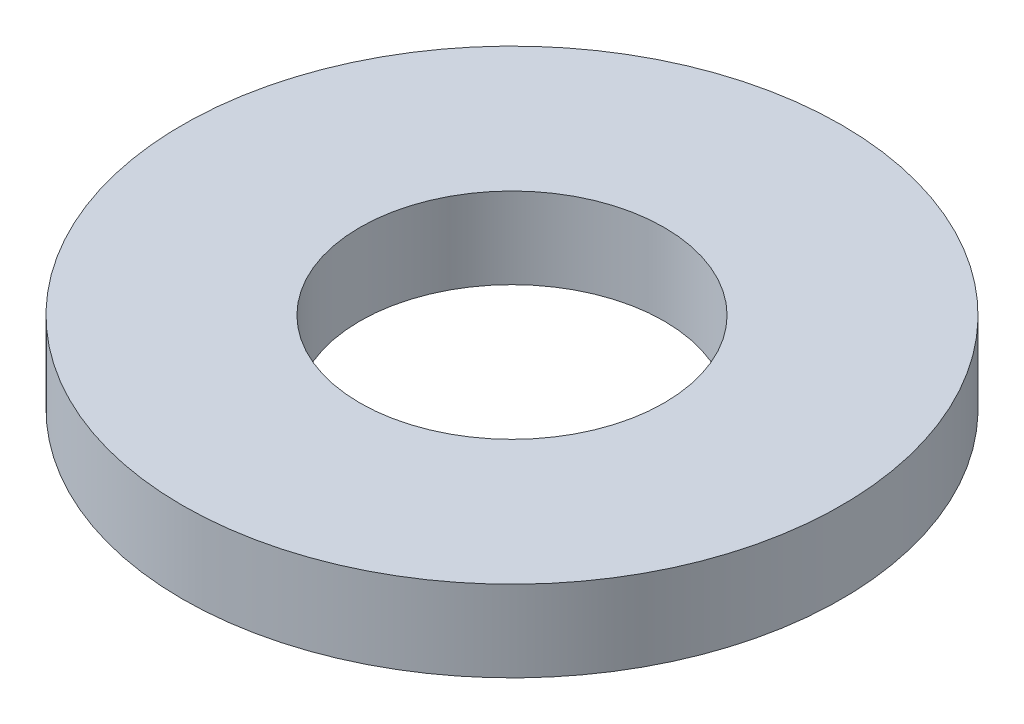
ISO-10303-21;
HEADER;
FILE_DESCRIPTION(('STEP AP214'),'2;1');
FILE_NAME('part.step','',(''),(''),'','','');
FILE_SCHEMA(('AUTOMOTIVE_DESIGN { 1 0 10303 214 1 1 1 1 }'));
ENDSEC;
DATA;
#1=APPLICATION_CONTEXT('core data for automotive mechanical design processes');
#2=APPLICATION_PROTOCOL_DEFINITION('international standard','automotive_design',2000,#1);
#3=PRODUCT_CONTEXT('',#1,'mechanical');
#4=PRODUCT('Part','Part','',(#3));
#5=PRODUCT_RELATED_PRODUCT_CATEGORY('part','',(#4));
#6=PRODUCT_DEFINITION_FORMATION('','',#4);
#7=PRODUCT_DEFINITION_CONTEXT('part definition',#1,'design');
#8=PRODUCT_DEFINITION('design','',#6,#7);
#9=PRODUCT_DEFINITION_SHAPE('','',#8);
#10=(LENGTH_UNIT() NAMED_UNIT(*) SI_UNIT(.MILLI.,.METRE.));
#11=(NAMED_UNIT(*) PLANE_ANGLE_UNIT() SI_UNIT($,.RADIAN.));
#12=(NAMED_UNIT(*) SI_UNIT($,.STERADIAN.) SOLID_ANGLE_UNIT());
#13=UNCERTAINTY_MEASURE_WITH_UNIT(LENGTH_MEASURE(1.E-05),#10,'distance_accuracy_value','');
#14=(GEOMETRIC_REPRESENTATION_CONTEXT(3) GLOBAL_UNCERTAINTY_ASSIGNED_CONTEXT((#13)) GLOBAL_UNIT_ASSIGNED_CONTEXT((#10,
#11,#12)) REPRESENTATION_CONTEXT('',''));
#15=CARTESIAN_POINT('',(0.,0.,0.));
#16=DIRECTION('',(0.,0.,1.));
#17=DIRECTION('',(1.,0.,0.));
#18=AXIS2_PLACEMENT_3D('',#15,#16,#17);
#19=CARTESIAN_POINT('',(0.,24.,0.));
#20=DIRECTION('',(0.,-1.,0.));
#21=DIRECTION('',(0.,0.,-1.));
#22=AXIS2_PLACEMENT_3D('',#19,#20,#21);
#23=CYLINDRICAL_SURFACE('',#22,97.5);
#24=CARTESIAN_POINT('',(0.,24.,0.));
#25=DIRECTION('',(0.,1.,0.));
#26=DIRECTION('',(0.,0.,1.));
#27=AXIS2_PLACEMENT_3D('',#24,#25,#26);
#28=CIRCLE('',#27,97.5);
#29=CARTESIAN_POINT('',(0.,24.,97.5));
#30=VERTEX_POINT('',#29);
#31=EDGE_CURVE('E10',#30,#30,#28,.T.);
#32=ORIENTED_EDGE('',*,*,#31,.F.);
#33=EDGE_LOOP('',(#32));
#34=FACE_BOUND('',#33,.T.);
#35=CARTESIAN_POINT('',(0.,0.,0.));
#36=DIRECTION('',(0.,1.,0.));
#37=DIRECTION('',(0.,0.,1.));
#38=AXIS2_PLACEMENT_3D('',#35,#36,#37);
#39=CIRCLE('',#38,97.5);
#40=CARTESIAN_POINT('',(0.,0.,97.5));
#41=VERTEX_POINT('',#40);
#42=EDGE_CURVE('E37',#41,#41,#39,.T.);
#43=ORIENTED_EDGE('',*,*,#42,.T.);
#44=EDGE_LOOP('',(#43));
#45=FACE_BOUND('',#44,.T.);
#46=ADVANCED_FACE('F40',(#34,#45),#23,.T.);
#47=CARTESIAN_POINT('',(0.,24.,0.));
#48=DIRECTION('',(0.,1.,0.));
#49=DIRECTION('',(0.,0.,1.));
#50=AXIS2_PLACEMENT_3D('',#47,#48,#49);
#51=PLANE('',#50);
#52=CARTESIAN_POINT('',(0.,24.,0.));
#53=DIRECTION('',(0.,1.,0.));
#54=DIRECTION('',(0.,0.,1.));
#55=AXIS2_PLACEMENT_3D('',#52,#53,#54);
#56=CIRCLE('',#55,45.);
#57=CARTESIAN_POINT('',(0.,24.,45.));
#58=VERTEX_POINT('',#57);
#59=EDGE_CURVE('E50',#58,#58,#56,.T.);
#60=ORIENTED_EDGE('',*,*,#59,.F.);
#61=EDGE_LOOP('',(#60));
#62=FACE_BOUND('',#61,.T.);
#63=ORIENTED_EDGE('',*,*,#31,.T.);
#64=EDGE_LOOP('',(#63));
#65=FACE_BOUND('',#64,.T.);
#66=ADVANCED_FACE('F59',(#62,#65),#51,.T.);
#67=CARTESIAN_POINT('',(0.,0.,0.));
#68=DIRECTION('',(0.,1.,0.));
#69=DIRECTION('',(0.,0.,1.));
#70=AXIS2_PLACEMENT_3D('',#67,#68,#69);
#71=PLANE('',#70);
#72=CARTESIAN_POINT('',(0.,0.,0.));
#73=DIRECTION('',(0.,1.,0.));
#74=DIRECTION('',(0.,0.,1.));
#75=AXIS2_PLACEMENT_3D('',#72,#73,#74);
#76=CIRCLE('',#75,45.);
#77=CARTESIAN_POINT('',(0.,0.,45.));
#78=VERTEX_POINT('',#77);
#79=EDGE_CURVE('E47',#78,#78,#76,.T.);
#80=ORIENTED_EDGE('',*,*,#79,.T.);
#81=EDGE_LOOP('',(#80));
#82=FACE_BOUND('',#81,.T.);
#83=ORIENTED_EDGE('',*,*,#42,.F.);
#84=EDGE_LOOP('',(#83));
#85=FACE_BOUND('',#84,.T.);
#86=ADVANCED_FACE('F58',(#82,#85),#71,.F.);
#87=CARTESIAN_POINT('',(0.,24.,0.));
#88=DIRECTION('',(0.,-1.,0.));
#89=DIRECTION('',(0.,0.,-1.));
#90=AXIS2_PLACEMENT_3D('',#87,#88,#89);
#91=CYLINDRICAL_SURFACE('',#90,45.);
#92=ORIENTED_EDGE('',*,*,#59,.T.);
#93=EDGE_LOOP('',(#92));
#94=FACE_BOUND('',#93,.T.);
#95=ORIENTED_EDGE('',*,*,#79,.F.);
#96=EDGE_LOOP('',(#95));
#97=FACE_BOUND('',#96,.T.);
#98=ADVANCED_FACE('F54',(#94,#97),#91,.F.);
#99=CLOSED_SHELL('',(#46,#66,#86,#98));
#100=MANIFOLD_SOLID_BREP('B2',#99);
#101=ADVANCED_BREP_SHAPE_REPRESENTATION('',(#18,#100),#14);
#102=SHAPE_DEFINITION_REPRESENTATION(#9,#101);
ENDSEC;
END-ISO-10303-21;
